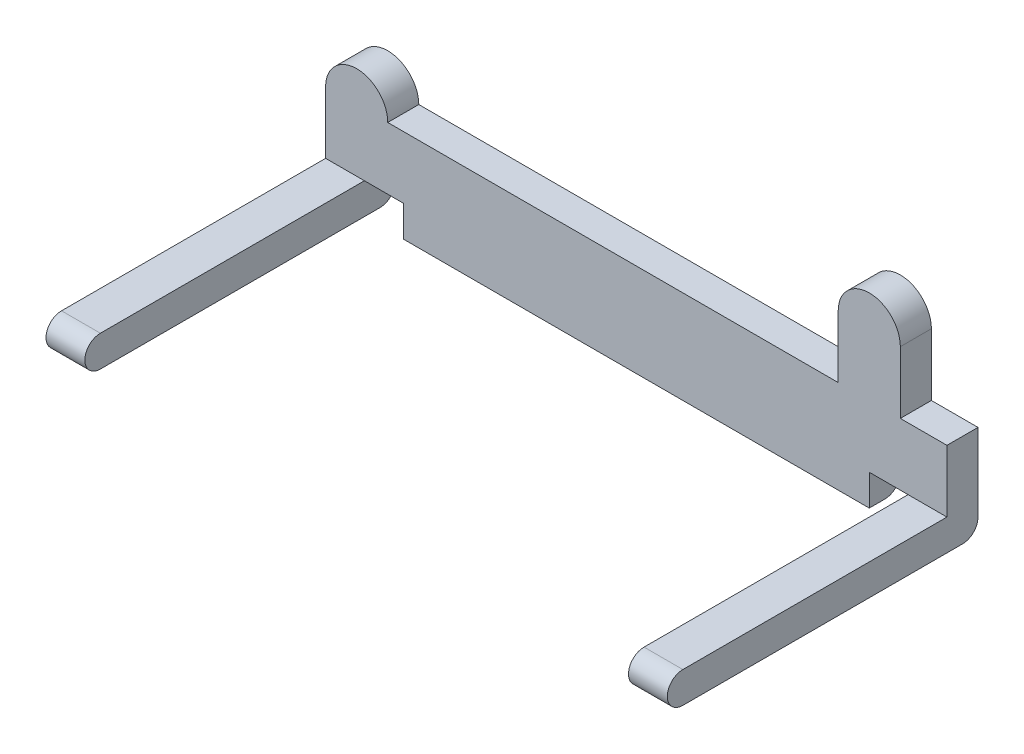
ISO-10303-21;
HEADER;
FILE_DESCRIPTION(('STEP AP214'),'2;1');
FILE_NAME('part.step','',(''),(''),'','','');
FILE_SCHEMA(('AUTOMOTIVE_DESIGN { 1 0 10303 214 1 1 1 1 }'));
ENDSEC;
DATA;
#1=APPLICATION_CONTEXT('core data for automotive mechanical design processes');
#2=APPLICATION_PROTOCOL_DEFINITION('international standard','automotive_design',2000,#1);
#3=PRODUCT_CONTEXT('',#1,'mechanical');
#4=PRODUCT('Part','Part','',(#3));
#5=PRODUCT_RELATED_PRODUCT_CATEGORY('part','',(#4));
#6=PRODUCT_DEFINITION_FORMATION('','',#4);
#7=PRODUCT_DEFINITION_CONTEXT('part definition',#1,'design');
#8=PRODUCT_DEFINITION('design','',#6,#7);
#9=PRODUCT_DEFINITION_SHAPE('','',#8);
#10=(LENGTH_UNIT() NAMED_UNIT(*) SI_UNIT(.MILLI.,.METRE.));
#11=(NAMED_UNIT(*) PLANE_ANGLE_UNIT() SI_UNIT($,.RADIAN.));
#12=(NAMED_UNIT(*) SI_UNIT($,.STERADIAN.) SOLID_ANGLE_UNIT());
#13=UNCERTAINTY_MEASURE_WITH_UNIT(LENGTH_MEASURE(1.E-05),#10,'distance_accuracy_value','');
#14=(GEOMETRIC_REPRESENTATION_CONTEXT(3) GLOBAL_UNCERTAINTY_ASSIGNED_CONTEXT((#13)) GLOBAL_UNIT_ASSIGNED_CONTEXT((#10,
#11,#12)) REPRESENTATION_CONTEXT('',''));
#15=CARTESIAN_POINT('',(0.,0.,0.));
#16=DIRECTION('',(0.,0.,1.));
#17=DIRECTION('',(1.,0.,0.));
#18=AXIS2_PLACEMENT_3D('',#15,#16,#17);
#19=CARTESIAN_POINT('',(80.,-2.,18.));
#20=DIRECTION('',(0.,1.,0.));
#21=DIRECTION('',(0.,0.,1.));
#22=AXIS2_PLACEMENT_3D('',#19,#20,#21);
#23=PLANE('',#22);
#24=DIRECTION('',(-1.,0.,0.));
#25=VECTOR('',#24,1.);
#26=CARTESIAN_POINT('',(80.,-1.99999999999999,-18.));
#27=LINE('',#26,#25);
#28=CARTESIAN_POINT('',(5.,-1.99999999999999,-18.));
#29=VERTEX_POINT('',#28);
#30=CARTESIAN_POINT('',(0.,-1.99999999999999,-18.));
#31=VERTEX_POINT('',#30);
#32=EDGE_CURVE('E312',#29,#31,#27,.T.);
#33=ORIENTED_EDGE('',*,*,#32,.F.);
#34=DIRECTION('',(0.,0.,1.));
#35=VECTOR('',#34,1.);
#36=CARTESIAN_POINT('',(4.99999999999999,-2.,18.));
#37=LINE('',#36,#35);
#38=CARTESIAN_POINT('',(4.99999999999999,-2.,18.));
#39=VERTEX_POINT('',#38);
#40=EDGE_CURVE('E218',#29,#39,#37,.T.);
#41=ORIENTED_EDGE('',*,*,#40,.T.);
#42=DIRECTION('',(-1.,0.,0.));
#43=VECTOR('',#42,1.);
#44=CARTESIAN_POINT('',(80.,-2.,18.));
#45=LINE('',#44,#43);
#46=CARTESIAN_POINT('',(0.,-2.,18.));
#47=VERTEX_POINT('',#46);
#48=EDGE_CURVE('E316',#39,#47,#45,.T.);
#49=ORIENTED_EDGE('',*,*,#48,.T.);
#50=DIRECTION('',(0.,0.,-1.));
#51=VECTOR('',#50,1.);
#52=CARTESIAN_POINT('',(0.,-2.,18.));
#53=LINE('',#52,#51);
#54=EDGE_CURVE('E295',#47,#31,#53,.T.);
#55=ORIENTED_EDGE('',*,*,#54,.T.);
#56=EDGE_LOOP('',(#33,#41,#49,#55));
#57=FACE_BOUND('',#56,.T.);
#58=ADVANCED_FACE('F38',(#57),#23,.F.);
#59=DIRECTION('',(0.,0.,-1.));
#60=VECTOR('',#59,1.);
#61=CARTESIAN_POINT('',(75.,-2.,18.));
#62=LINE('',#61,#60);
#63=CARTESIAN_POINT('',(75.,-2.,18.));
#64=VERTEX_POINT('',#63);
#65=CARTESIAN_POINT('',(75.,-2.,-18.));
#66=VERTEX_POINT('',#65);
#67=EDGE_CURVE('E225',#64,#66,#62,.T.);
#68=ORIENTED_EDGE('',*,*,#67,.T.);
#69=CARTESIAN_POINT('',(80.,-1.99999999999999,-18.));
#70=VERTEX_POINT('',#69);
#71=EDGE_CURVE('E314',#70,#66,#27,.T.);
#72=ORIENTED_EDGE('',*,*,#71,.F.);
#73=DIRECTION('',(0.,0.,-1.));
#74=VECTOR('',#73,1.);
#75=CARTESIAN_POINT('',(80.,-2.,18.));
#76=LINE('',#75,#74);
#77=CARTESIAN_POINT('',(80.,-2.,18.));
#78=VERTEX_POINT('',#77);
#79=EDGE_CURVE('E282',#78,#70,#76,.T.);
#80=ORIENTED_EDGE('',*,*,#79,.F.);
#81=EDGE_CURVE('E46',#78,#64,#45,.T.);
#82=ORIENTED_EDGE('',*,*,#81,.T.);
#83=EDGE_LOOP('',(#68,#72,#80,#82));
#84=FACE_BOUND('',#83,.T.);
#85=ADVANCED_FACE('F407',(#84),#23,.F.);
#86=CARTESIAN_POINT('',(80.,0.,-18.));
#87=DIRECTION('',(-1.,0.,0.));
#88=DIRECTION('',(0.,0.,1.));
#89=AXIS2_PLACEMENT_3D('',#86,#87,#88);
#90=CYLINDRICAL_SURFACE('',#89,2.);
#91=DIRECTION('',(-1.,0.,0.));
#92=VECTOR('',#91,1.);
#93=CARTESIAN_POINT('',(80.,0.,-20.));
#94=LINE('',#93,#92);
#95=CARTESIAN_POINT('',(4.99999999999999,0.,-20.));
#96=VERTEX_POINT('',#95);
#97=CARTESIAN_POINT('',(0.,0.,-20.));
#98=VERTEX_POINT('',#97);
#99=EDGE_CURVE('E308',#96,#98,#94,.T.);
#100=ORIENTED_EDGE('',*,*,#99,.F.);
#101=CARTESIAN_POINT('',(4.99999999999999,0.,-18.));
#102=DIRECTION('',(-1.,0.,0.));
#103=DIRECTION('',(0.,0.,1.));
#104=AXIS2_PLACEMENT_3D('',#101,#102,#103);
#105=CIRCLE('',#104,2.);
#106=EDGE_CURVE('E400',#96,#29,#105,.T.);
#107=ORIENTED_EDGE('',*,*,#106,.T.);
#108=ORIENTED_EDGE('',*,*,#32,.T.);
#109=CARTESIAN_POINT('',(0.,0.,-18.));
#110=DIRECTION('',(1.,0.,0.));
#111=DIRECTION('',(0.,0.,-1.));
#112=AXIS2_PLACEMENT_3D('',#109,#110,#111);
#113=CIRCLE('',#112,2.);
#114=EDGE_CURVE('E298',#31,#98,#113,.T.);
#115=ORIENTED_EDGE('',*,*,#114,.T.);
#116=EDGE_LOOP('',(#100,#107,#108,#115));
#117=FACE_BOUND('',#116,.T.);
#118=ADVANCED_FACE('F429',(#117),#90,.T.);
#119=ORIENTED_EDGE('',*,*,#71,.T.);
#120=CARTESIAN_POINT('',(75.,0.,-18.));
#121=DIRECTION('',(1.,0.,0.));
#122=DIRECTION('',(0.,0.,-1.));
#123=AXIS2_PLACEMENT_3D('',#120,#121,#122);
#124=CIRCLE('',#123,2.);
#125=CARTESIAN_POINT('',(75.,0.,-20.));
#126=VERTEX_POINT('',#125);
#127=EDGE_CURVE('E375',#66,#126,#124,.T.);
#128=ORIENTED_EDGE('',*,*,#127,.T.);
#129=CARTESIAN_POINT('',(80.,0.,-20.));
#130=VERTEX_POINT('',#129);
#131=EDGE_CURVE('E309',#130,#126,#94,.T.);
#132=ORIENTED_EDGE('',*,*,#131,.F.);
#133=CARTESIAN_POINT('',(80.,0.,-18.));
#134=DIRECTION('',(1.,0.,0.));
#135=DIRECTION('',(0.,0.,-1.));
#136=AXIS2_PLACEMENT_3D('',#133,#134,#135);
#137=CIRCLE('',#136,2.);
#138=EDGE_CURVE('E285',#70,#130,#137,.T.);
#139=ORIENTED_EDGE('',*,*,#138,.F.);
#140=EDGE_LOOP('',(#119,#128,#132,#139));
#141=FACE_BOUND('',#140,.T.);
#142=ADVANCED_FACE('F373',(#141),#90,.T.);
#143=CARTESIAN_POINT('',(80.,0.,18.));
#144=DIRECTION('',(-1.,0.,0.));
#145=DIRECTION('',(0.,0.,1.));
#146=AXIS2_PLACEMENT_3D('',#143,#144,#145);
#147=CYLINDRICAL_SURFACE('',#146,2.);
#148=ORIENTED_EDGE('',*,*,#48,.F.);
#149=CARTESIAN_POINT('',(4.99999999999999,0.,18.));
#150=DIRECTION('',(-1.,0.,0.));
#151=DIRECTION('',(0.,0.,1.));
#152=AXIS2_PLACEMENT_3D('',#149,#150,#151);
#153=CIRCLE('',#152,2.);
#154=CARTESIAN_POINT('',(5.,2.,18.));
#155=VERTEX_POINT('',#154);
#156=EDGE_CURVE('E222',#39,#155,#153,.T.);
#157=ORIENTED_EDGE('',*,*,#156,.T.);
#158=DIRECTION('',(-1.,0.,0.));
#159=VECTOR('',#158,1.);
#160=CARTESIAN_POINT('',(80.,2.,18.));
#161=LINE('',#160,#159);
#162=CARTESIAN_POINT('',(0.,2.,18.));
#163=VERTEX_POINT('',#162);
#164=EDGE_CURVE('E292',#155,#163,#161,.T.);
#165=ORIENTED_EDGE('',*,*,#164,.T.);
#166=CARTESIAN_POINT('',(0.,0.,18.));
#167=DIRECTION('',(1.,0.,0.));
#168=DIRECTION('',(0.,0.,-1.));
#169=AXIS2_PLACEMENT_3D('',#166,#167,#168);
#170=CIRCLE('',#169,2.);
#171=EDGE_CURVE('E271',#163,#47,#170,.T.);
#172=ORIENTED_EDGE('',*,*,#171,.T.);
#173=EDGE_LOOP('',(#148,#157,#165,#172));
#174=FACE_BOUND('',#173,.T.);
#175=ADVANCED_FACE('F331',(#174),#147,.T.);
#176=CARTESIAN_POINT('',(80.,2.,18.));
#177=DIRECTION('',(0.,-1.,0.));
#178=DIRECTION('',(0.,0.,-1.));
#179=AXIS2_PLACEMENT_3D('',#176,#177,#178);
#180=PLANE('',#179);
#181=ORIENTED_EDGE('',*,*,#164,.F.);
#182=DIRECTION('',(0.,0.,1.));
#183=VECTOR('',#182,1.);
#184=CARTESIAN_POINT('',(5.,2.00000000000001,-16.));
#185=LINE('',#184,#183);
#186=CARTESIAN_POINT('',(5.,2.00000000000001,-16.));
#187=VERTEX_POINT('',#186);
#188=EDGE_CURVE('E403',#187,#155,#185,.T.);
#189=ORIENTED_EDGE('',*,*,#188,.F.);
#190=DIRECTION('',(1.,0.,0.));
#191=VECTOR('',#190,1.);
#192=CARTESIAN_POINT('',(0.,2.00000000000001,-16.));
#193=LINE('',#192,#191);
#194=CARTESIAN_POINT('',(0.,2.00000000000001,-16.));
#195=VERTEX_POINT('',#194);
#196=EDGE_CURVE('E269',#195,#187,#193,.T.);
#197=ORIENTED_EDGE('',*,*,#196,.F.);
#198=DIRECTION('',(0.,0.,1.));
#199=VECTOR('',#198,1.);
#200=CARTESIAN_POINT('',(0.,2.,18.));
#201=LINE('',#200,#199);
#202=EDGE_CURVE('E283',#195,#163,#201,.T.);
#203=ORIENTED_EDGE('',*,*,#202,.T.);
#204=EDGE_LOOP('',(#181,#189,#197,#203));
#205=FACE_BOUND('',#204,.T.);
#206=ADVANCED_FACE('F336',(#205),#180,.F.);
#207=CARTESIAN_POINT('',(0.,10.,-20.));
#208=DIRECTION('',(0.,1.,0.));
#209=DIRECTION('',(0.,0.,1.));
#210=AXIS2_PLACEMENT_3D('',#207,#208,#209);
#211=PLANE('',#210);
#212=DIRECTION('',(0.,0.,-1.));
#213=VECTOR('',#212,1.);
#214=CARTESIAN_POINT('',(66.,9.99999999999999,-16.));
#215=LINE('',#214,#213);
#216=CARTESIAN_POINT('',(66.,9.99999999999999,-16.));
#217=VERTEX_POINT('',#216);
#218=CARTESIAN_POINT('',(66.,9.99999999999999,-20.));
#219=VERTEX_POINT('',#218);
#220=EDGE_CURVE('E248',#217,#219,#215,.T.);
#221=ORIENTED_EDGE('',*,*,#220,.T.);
#222=DIRECTION('',(1.,0.,0.));
#223=VECTOR('',#222,1.);
#224=CARTESIAN_POINT('',(0.,10.,-20.));
#225=LINE('',#224,#223);
#226=CARTESIAN_POINT('',(8.,10.,-20.));
#227=VERTEX_POINT('',#226);
#228=EDGE_CURVE('E277',#227,#219,#225,.T.);
#229=ORIENTED_EDGE('',*,*,#228,.F.);
#230=DIRECTION('',(0.,0.,-1.));
#231=VECTOR('',#230,1.);
#232=CARTESIAN_POINT('',(8.,10.,-16.));
#233=LINE('',#232,#231);
#234=CARTESIAN_POINT('',(8.,10.,-16.));
#235=VERTEX_POINT('',#234);
#236=EDGE_CURVE('E11',#235,#227,#233,.T.);
#237=ORIENTED_EDGE('',*,*,#236,.F.);
#238=DIRECTION('',(1.,0.,0.));
#239=VECTOR('',#238,1.);
#240=CARTESIAN_POINT('',(0.,10.,-16.));
#241=LINE('',#240,#239);
#242=EDGE_CURVE('E273',#235,#217,#241,.T.);
#243=ORIENTED_EDGE('',*,*,#242,.T.);
#244=EDGE_LOOP('',(#221,#229,#237,#243));
#245=FACE_BOUND('',#244,.T.);
#246=ADVANCED_FACE('F347',(#245),#211,.T.);
#247=CARTESIAN_POINT('',(80.,2.,18.));
#248=VERTEX_POINT('',#247);
#249=CARTESIAN_POINT('',(75.,2.,18.));
#250=VERTEX_POINT('',#249);
#251=EDGE_CURVE('E305',#248,#250,#161,.T.);
#252=ORIENTED_EDGE('',*,*,#251,.T.);
#253=CARTESIAN_POINT('',(75.,0.,18.));
#254=DIRECTION('',(1.,0.,0.));
#255=DIRECTION('',(0.,0.,-1.));
#256=AXIS2_PLACEMENT_3D('',#253,#254,#255);
#257=CIRCLE('',#256,2.);
#258=EDGE_CURVE('E219',#250,#64,#257,.T.);
#259=ORIENTED_EDGE('',*,*,#258,.T.);
#260=ORIENTED_EDGE('',*,*,#81,.F.);
#261=CARTESIAN_POINT('',(80.,0.,18.));
#262=DIRECTION('',(1.,0.,0.));
#263=DIRECTION('',(0.,0.,-1.));
#264=AXIS2_PLACEMENT_3D('',#261,#262,#263);
#265=CIRCLE('',#264,2.);
#266=EDGE_CURVE('E279',#248,#78,#265,.T.);
#267=ORIENTED_EDGE('',*,*,#266,.F.);
#268=EDGE_LOOP('',(#252,#259,#260,#267));
#269=FACE_BOUND('',#268,.T.);
#270=ADVANCED_FACE('F40',(#269),#147,.T.);
#271=DIRECTION('',(-1.,0.,0.));
#272=VECTOR('',#271,1.);
#273=CARTESIAN_POINT('',(80.,-1.99999999999999,-16.));
#274=LINE('',#273,#272);
#275=CARTESIAN_POINT('',(70.,-2.,-16.));
#276=VERTEX_POINT('',#275);
#277=CARTESIAN_POINT('',(9.99999999999999,-2.,-16.));
#278=VERTEX_POINT('',#277);
#279=EDGE_CURVE('E212',#276,#278,#274,.T.);
#280=ORIENTED_EDGE('',*,*,#279,.T.);
#281=DIRECTION('',(0.,0.,1.));
#282=VECTOR('',#281,1.);
#283=CARTESIAN_POINT('',(9.99999999999999,-2.,-26.));
#284=LINE('',#283,#282);
#285=CARTESIAN_POINT('',(9.99999999999999,-2.,-18.));
#286=VERTEX_POINT('',#285);
#287=EDGE_CURVE('E193',#286,#278,#284,.T.);
#288=ORIENTED_EDGE('',*,*,#287,.F.);
#289=CARTESIAN_POINT('',(70.,-2.,-18.));
#290=VERTEX_POINT('',#289);
#291=EDGE_CURVE('E317',#290,#286,#27,.T.);
#292=ORIENTED_EDGE('',*,*,#291,.F.);
#293=DIRECTION('',(0.,0.,1.));
#294=VECTOR('',#293,1.);
#295=CARTESIAN_POINT('',(70.,-2.,-26.));
#296=LINE('',#295,#294);
#297=EDGE_CURVE('E214',#290,#276,#296,.T.);
#298=ORIENTED_EDGE('',*,*,#297,.T.);
#299=EDGE_LOOP('',(#280,#288,#292,#298));
#300=FACE_BOUND('',#299,.T.);
#301=ADVANCED_FACE('F217',(#300),#23,.F.);
#302=ORIENTED_EDGE('',*,*,#291,.T.);
#303=CARTESIAN_POINT('',(9.99999999999999,0.,-18.));
#304=DIRECTION('',(1.,0.,0.));
#305=DIRECTION('',(0.,1.,0.));
#306=AXIS2_PLACEMENT_3D('',#303,#304,#305);
#307=CIRCLE('',#306,2.);
#308=CARTESIAN_POINT('',(9.99999999999999,0.,-20.));
#309=VERTEX_POINT('',#308);
#310=EDGE_CURVE('E200',#286,#309,#307,.T.);
#311=ORIENTED_EDGE('',*,*,#310,.T.);
#312=CARTESIAN_POINT('',(70.,0.,-20.));
#313=VERTEX_POINT('',#312);
#314=EDGE_CURVE('E313',#313,#309,#94,.T.);
#315=ORIENTED_EDGE('',*,*,#314,.F.);
#316=CARTESIAN_POINT('',(70.,0.,-18.));
#317=DIRECTION('',(-1.,0.,0.));
#318=DIRECTION('',(0.,0.,1.));
#319=AXIS2_PLACEMENT_3D('',#316,#317,#318);
#320=CIRCLE('',#319,2.);
#321=EDGE_CURVE('E383',#313,#290,#320,.T.);
#322=ORIENTED_EDGE('',*,*,#321,.T.);
#323=EDGE_LOOP('',(#302,#311,#315,#322));
#324=FACE_BOUND('',#323,.T.);
#325=ADVANCED_FACE('F432',(#324),#90,.T.);
#326=CARTESIAN_POINT('',(80.,2.00000000000001,-20.));
#327=DIRECTION('',(0.,0.,1.));
#328=DIRECTION('',(1.,0.,0.));
#329=AXIS2_PLACEMENT_3D('',#326,#327,#328);
#330=PLANE('',#329);
#331=DIRECTION('',(-1.,0.,0.));
#332=VECTOR('',#331,1.);
#333=CARTESIAN_POINT('',(80.,2.00000000000001,-20.));
#334=LINE('',#333,#332);
#335=CARTESIAN_POINT('',(10.,2.00000000000001,-20.));
#336=VERTEX_POINT('',#335);
#337=CARTESIAN_POINT('',(5.,2.00000000000001,-20.));
#338=VERTEX_POINT('',#337);
#339=EDGE_CURVE('E395',#336,#338,#334,.T.);
#340=ORIENTED_EDGE('',*,*,#339,.T.);
#341=DIRECTION('',(0.,-1.,0.));
#342=VECTOR('',#341,1.);
#343=CARTESIAN_POINT('',(4.99999999999999,2.00000000000001,-20.));
#344=LINE('',#343,#342);
#345=EDGE_CURVE('E397',#338,#96,#344,.T.);
#346=ORIENTED_EDGE('',*,*,#345,.T.);
#347=ORIENTED_EDGE('',*,*,#99,.T.);
#348=DIRECTION('',(0.,1.,0.));
#349=VECTOR('',#348,1.);
#350=CARTESIAN_POINT('',(0.,2.00000000000001,-20.));
#351=LINE('',#350,#349);
#352=CARTESIAN_POINT('',(0.,10.,-20.));
#353=VERTEX_POINT('',#352);
#354=EDGE_CURVE('E301',#98,#353,#351,.T.);
#355=ORIENTED_EDGE('',*,*,#354,.T.);
#356=CARTESIAN_POINT('',(4.,10.,-20.));
#357=DIRECTION('',(0.,0.,-1.));
#358=DIRECTION('',(-1.,0.,0.));
#359=AXIS2_PLACEMENT_3D('',#356,#357,#358);
#360=CIRCLE('',#359,4.);
#361=EDGE_CURVE('E60',#353,#227,#360,.T.);
#362=ORIENTED_EDGE('',*,*,#361,.T.);
#363=ORIENTED_EDGE('',*,*,#228,.T.);
#364=DIRECTION('',(0.,1.,0.));
#365=VECTOR('',#364,1.);
#366=CARTESIAN_POINT('',(66.,9.99999999999999,-20.));
#367=LINE('',#366,#365);
#368=CARTESIAN_POINT('',(66.,18.,-20.));
#369=VERTEX_POINT('',#368);
#370=EDGE_CURVE('E236',#219,#369,#367,.T.);
#371=ORIENTED_EDGE('',*,*,#370,.T.);
#372=CARTESIAN_POINT('',(70.,18.,-20.));
#373=DIRECTION('',(0.,0.,-1.));
#374=DIRECTION('',(-1.,0.,0.));
#375=AXIS2_PLACEMENT_3D('',#372,#373,#374);
#376=CIRCLE('',#375,4.);
#377=CARTESIAN_POINT('',(74.,18.,-20.));
#378=VERTEX_POINT('',#377);
#379=EDGE_CURVE('E231',#369,#378,#376,.T.);
#380=ORIENTED_EDGE('',*,*,#379,.T.);
#381=DIRECTION('',(0.,-1.,0.));
#382=VECTOR('',#381,1.);
#383=CARTESIAN_POINT('',(74.,10.,-20.));
#384=LINE('',#383,#382);
#385=CARTESIAN_POINT('',(74.,10.,-20.));
#386=VERTEX_POINT('',#385);
#387=EDGE_CURVE('E53',#378,#386,#384,.T.);
#388=ORIENTED_EDGE('',*,*,#387,.T.);
#389=CARTESIAN_POINT('',(80.,10.,-20.));
#390=VERTEX_POINT('',#389);
#391=EDGE_CURVE('E264',#386,#390,#225,.T.);
#392=ORIENTED_EDGE('',*,*,#391,.T.);
#393=DIRECTION('',(0.,1.,0.));
#394=VECTOR('',#393,1.);
#395=CARTESIAN_POINT('',(80.,2.00000000000001,-20.));
#396=LINE('',#395,#394);
#397=EDGE_CURVE('E287',#130,#390,#396,.T.);
#398=ORIENTED_EDGE('',*,*,#397,.F.);
#399=ORIENTED_EDGE('',*,*,#131,.T.);
#400=DIRECTION('',(0.,1.,0.));
#401=VECTOR('',#400,1.);
#402=CARTESIAN_POINT('',(75.,2.00000000000001,-20.));
#403=LINE('',#402,#401);
#404=CARTESIAN_POINT('',(75.,2.00000000000001,-20.));
#405=VERTEX_POINT('',#404);
#406=EDGE_CURVE('E378',#126,#405,#403,.T.);
#407=ORIENTED_EDGE('',*,*,#406,.T.);
#408=DIRECTION('',(-1.,0.,0.));
#409=VECTOR('',#408,1.);
#410=CARTESIAN_POINT('',(80.,2.00000000000001,-20.));
#411=LINE('',#410,#409);
#412=CARTESIAN_POINT('',(70.,2.00000000000001,-20.));
#413=VERTEX_POINT('',#412);
#414=EDGE_CURVE('E380',#405,#413,#411,.T.);
#415=ORIENTED_EDGE('',*,*,#414,.T.);
#416=DIRECTION('',(0.,-1.,0.));
#417=VECTOR('',#416,1.);
#418=CARTESIAN_POINT('',(70.,2.00000000000001,-20.));
#419=LINE('',#418,#417);
#420=EDGE_CURVE('E388',#413,#313,#419,.T.);
#421=ORIENTED_EDGE('',*,*,#420,.T.);
#422=ORIENTED_EDGE('',*,*,#314,.T.);
#423=DIRECTION('',(0.,1.,0.));
#424=VECTOR('',#423,1.);
#425=CARTESIAN_POINT('',(9.99999999999999,2.00000000000007,-20.));
#426=LINE('',#425,#424);
#427=EDGE_CURVE('E385',#309,#336,#426,.T.);
#428=ORIENTED_EDGE('',*,*,#427,.T.);
#429=EDGE_LOOP('',(#340,#346,#347,#355,#362,#363,#371,#380,#388,#392,#398,#399,#407,#415,#421,
#422,#428));
#430=FACE_BOUND('',#429,.T.);
#431=ADVANCED_FACE('F349',(#430),#330,.F.);
#432=CARTESIAN_POINT('',(75.,2.00000000000001,-16.));
#433=VERTEX_POINT('',#432);
#434=CARTESIAN_POINT('',(80.,2.00000000000001,-16.));
#435=VERTEX_POINT('',#434);
#436=EDGE_CURVE('E272',#433,#435,#193,.T.);
#437=ORIENTED_EDGE('',*,*,#436,.F.);
#438=DIRECTION('',(0.,0.,-1.));
#439=VECTOR('',#438,1.);
#440=CARTESIAN_POINT('',(75.,2.00000000000001,-16.));
#441=LINE('',#440,#439);
#442=EDGE_CURVE('E405',#250,#433,#441,.T.);
#443=ORIENTED_EDGE('',*,*,#442,.F.);
#444=ORIENTED_EDGE('',*,*,#251,.F.);
#445=DIRECTION('',(0.,0.,1.));
#446=VECTOR('',#445,1.);
#447=CARTESIAN_POINT('',(80.,2.00000000000001,-18.));
#448=LINE('',#447,#446);
#449=EDGE_CURVE('E290',#435,#248,#448,.T.);
#450=ORIENTED_EDGE('',*,*,#449,.F.);
#451=EDGE_LOOP('',(#437,#443,#444,#450));
#452=FACE_BOUND('',#451,.T.);
#453=ADVANCED_FACE('F449',(#452),#180,.F.);
#454=CARTESIAN_POINT('',(80.,0.,18.));
#455=DIRECTION('',(1.,0.,0.));
#456=DIRECTION('',(0.,0.,-1.));
#457=AXIS2_PLACEMENT_3D('',#454,#455,#456);
#458=PLANE('',#457);
#459=ORIENTED_EDGE('',*,*,#266,.T.);
#460=ORIENTED_EDGE('',*,*,#79,.T.);
#461=ORIENTED_EDGE('',*,*,#138,.T.);
#462=ORIENTED_EDGE('',*,*,#397,.T.);
#463=DIRECTION('',(0.,0.,1.));
#464=VECTOR('',#463,1.);
#465=CARTESIAN_POINT('',(80.,10.,-20.));
#466=LINE('',#465,#464);
#467=CARTESIAN_POINT('',(80.,10.,-16.));
#468=VERTEX_POINT('',#467);
#469=EDGE_CURVE('E256',#390,#468,#466,.T.);
#470=ORIENTED_EDGE('',*,*,#469,.T.);
#471=DIRECTION('',(0.,-1.,0.));
#472=VECTOR('',#471,1.);
#473=CARTESIAN_POINT('',(80.,2.00000000000001,-16.));
#474=LINE('',#473,#472);
#475=EDGE_CURVE('E261',#468,#435,#474,.T.);
#476=ORIENTED_EDGE('',*,*,#475,.T.);
#477=ORIENTED_EDGE('',*,*,#449,.T.);
#478=EDGE_LOOP('',(#459,#460,#461,#462,#470,#476,#477));
#479=FACE_BOUND('',#478,.T.);
#480=ADVANCED_FACE('F367',(#479),#458,.T.);
#481=CARTESIAN_POINT('',(0.,0.,18.));
#482=DIRECTION('',(1.,0.,0.));
#483=DIRECTION('',(0.,0.,-1.));
#484=AXIS2_PLACEMENT_3D('',#481,#482,#483);
#485=PLANE('',#484);
#486=ORIENTED_EDGE('',*,*,#171,.F.);
#487=ORIENTED_EDGE('',*,*,#202,.F.);
#488=DIRECTION('',(0.,-1.,0.));
#489=VECTOR('',#488,1.);
#490=CARTESIAN_POINT('',(0.,2.00000000000001,-16.));
#491=LINE('',#490,#489);
#492=CARTESIAN_POINT('',(0.,10.,-16.));
#493=VERTEX_POINT('',#492);
#494=EDGE_CURVE('E260',#493,#195,#491,.T.);
#495=ORIENTED_EDGE('',*,*,#494,.F.);
#496=DIRECTION('',(0.,0.,1.));
#497=VECTOR('',#496,1.);
#498=CARTESIAN_POINT('',(0.,10.,-20.));
#499=LINE('',#498,#497);
#500=EDGE_CURVE('E258',#353,#493,#499,.T.);
#501=ORIENTED_EDGE('',*,*,#500,.F.);
#502=ORIENTED_EDGE('',*,*,#354,.F.);
#503=ORIENTED_EDGE('',*,*,#114,.F.);
#504=ORIENTED_EDGE('',*,*,#54,.F.);
#505=EDGE_LOOP('',(#486,#487,#495,#501,#502,#503,#504));
#506=FACE_BOUND('',#505,.T.);
#507=ADVANCED_FACE('F329',(#506),#485,.F.);
#508=CARTESIAN_POINT('',(0.,2.00000000000001,-16.));
#509=DIRECTION('',(0.,0.,1.));
#510=DIRECTION('',(1.,0.,0.));
#511=AXIS2_PLACEMENT_3D('',#508,#509,#510);
#512=PLANE('',#511);
#513=DIRECTION('',(-1.,0.,0.));
#514=VECTOR('',#513,1.);
#515=CARTESIAN_POINT('',(5.,2.00000000000001,-16.));
#516=LINE('',#515,#514);
#517=CARTESIAN_POINT('',(10.,2.00000000000001,-16.));
#518=VERTEX_POINT('',#517);
#519=EDGE_CURVE('E206',#518,#187,#516,.T.);
#520=ORIENTED_EDGE('',*,*,#519,.F.);
#521=DIRECTION('',(0.,1.,0.));
#522=VECTOR('',#521,1.);
#523=CARTESIAN_POINT('',(10.,2.00000000000001,-16.));
#524=LINE('',#523,#522);
#525=EDGE_CURVE('E197',#278,#518,#524,.T.);
#526=ORIENTED_EDGE('',*,*,#525,.F.);
#527=ORIENTED_EDGE('',*,*,#279,.F.);
#528=DIRECTION('',(0.,-1.,0.));
#529=VECTOR('',#528,1.);
#530=CARTESIAN_POINT('',(70.,2.00000000000001,-16.));
#531=LINE('',#530,#529);
#532=CARTESIAN_POINT('',(70.,2.00000000000001,-16.));
#533=VERTEX_POINT('',#532);
#534=EDGE_CURVE('E542',#533,#276,#531,.T.);
#535=ORIENTED_EDGE('',*,*,#534,.F.);
#536=DIRECTION('',(-1.,0.,0.));
#537=VECTOR('',#536,1.);
#538=CARTESIAN_POINT('',(75.,2.00000000000001,-16.));
#539=LINE('',#538,#537);
#540=EDGE_CURVE('E539',#433,#533,#539,.T.);
#541=ORIENTED_EDGE('',*,*,#540,.F.);
#542=ORIENTED_EDGE('',*,*,#436,.T.);
#543=ORIENTED_EDGE('',*,*,#475,.F.);
#544=CARTESIAN_POINT('',(74.,10.,-16.));
#545=VERTEX_POINT('',#544);
#546=EDGE_CURVE('E276',#545,#468,#241,.T.);
#547=ORIENTED_EDGE('',*,*,#546,.F.);
#548=DIRECTION('',(0.,-1.,0.));
#549=VECTOR('',#548,1.);
#550=CARTESIAN_POINT('',(74.,10.,-16.));
#551=LINE('',#550,#549);
#552=CARTESIAN_POINT('',(74.,18.,-16.));
#553=VERTEX_POINT('',#552);
#554=EDGE_CURVE('E235',#553,#545,#551,.T.);
#555=ORIENTED_EDGE('',*,*,#554,.F.);
#556=CARTESIAN_POINT('',(70.,18.,-16.));
#557=DIRECTION('',(0.,0.,-1.));
#558=DIRECTION('',(-1.,0.,0.));
#559=AXIS2_PLACEMENT_3D('',#556,#557,#558);
#560=CIRCLE('',#559,4.);
#561=CARTESIAN_POINT('',(66.,18.,-16.));
#562=VERTEX_POINT('',#561);
#563=EDGE_CURVE('E232',#562,#553,#560,.T.);
#564=ORIENTED_EDGE('',*,*,#563,.F.);
#565=DIRECTION('',(0.,1.,0.));
#566=VECTOR('',#565,1.);
#567=CARTESIAN_POINT('',(66.,9.99999999999999,-16.));
#568=LINE('',#567,#566);
#569=EDGE_CURVE('E238',#217,#562,#568,.T.);
#570=ORIENTED_EDGE('',*,*,#569,.F.);
#571=ORIENTED_EDGE('',*,*,#242,.F.);
#572=CARTESIAN_POINT('',(4.,10.,-16.));
#573=DIRECTION('',(0.,0.,-1.));
#574=DIRECTION('',(-1.,0.,0.));
#575=AXIS2_PLACEMENT_3D('',#572,#573,#574);
#576=CIRCLE('',#575,4.);
#577=EDGE_CURVE('E254',#493,#235,#576,.T.);
#578=ORIENTED_EDGE('',*,*,#577,.F.);
#579=ORIENTED_EDGE('',*,*,#494,.T.);
#580=ORIENTED_EDGE('',*,*,#196,.T.);
#581=EDGE_LOOP('',(#520,#526,#527,#535,#541,#542,#543,#547,#555,#564,#570,#571,#578,#579,#580));
#582=FACE_BOUND('',#581,.T.);
#583=ADVANCED_FACE('F210',(#582),#512,.T.);
#584=DIRECTION('',(0.,0.,-1.));
#585=VECTOR('',#584,1.);
#586=CARTESIAN_POINT('',(74.,10.,-16.));
#587=LINE('',#586,#585);
#588=EDGE_CURVE('E251',#545,#386,#587,.T.);
#589=ORIENTED_EDGE('',*,*,#588,.F.);
#590=ORIENTED_EDGE('',*,*,#546,.T.);
#591=ORIENTED_EDGE('',*,*,#469,.F.);
#592=ORIENTED_EDGE('',*,*,#391,.F.);
#593=EDGE_LOOP('',(#589,#590,#591,#592));
#594=FACE_BOUND('',#593,.T.);
#595=ADVANCED_FACE('F364',(#594),#211,.T.);
#596=CARTESIAN_POINT('',(4.,10.,-16.));
#597=DIRECTION('',(0.,0.,-1.));
#598=DIRECTION('',(-1.,0.,0.));
#599=AXIS2_PLACEMENT_3D('',#596,#597,#598);
#600=CYLINDRICAL_SURFACE('',#599,4.);
#601=ORIENTED_EDGE('',*,*,#577,.T.);
#602=ORIENTED_EDGE('',*,*,#236,.T.);
#603=ORIENTED_EDGE('',*,*,#361,.F.);
#604=ORIENTED_EDGE('',*,*,#500,.T.);
#605=EDGE_LOOP('',(#601,#602,#603,#604));
#606=FACE_BOUND('',#605,.T.);
#607=ADVANCED_FACE('F344',(#606),#600,.T.);
#608=CARTESIAN_POINT('',(70.,18.,-16.));
#609=DIRECTION('',(0.,0.,-1.));
#610=DIRECTION('',(-1.,0.,0.));
#611=AXIS2_PLACEMENT_3D('',#608,#609,#610);
#612=CYLINDRICAL_SURFACE('',#611,4.);
#613=ORIENTED_EDGE('',*,*,#379,.F.);
#614=DIRECTION('',(0.,0.,-1.));
#615=VECTOR('',#614,1.);
#616=CARTESIAN_POINT('',(66.,18.,-16.));
#617=LINE('',#616,#615);
#618=EDGE_CURVE('E246',#562,#369,#617,.T.);
#619=ORIENTED_EDGE('',*,*,#618,.F.);
#620=ORIENTED_EDGE('',*,*,#563,.T.);
#621=DIRECTION('',(0.,0.,-1.));
#622=VECTOR('',#621,1.);
#623=CARTESIAN_POINT('',(74.,18.,-16.));
#624=LINE('',#623,#622);
#625=EDGE_CURVE('E241',#553,#378,#624,.T.);
#626=ORIENTED_EDGE('',*,*,#625,.T.);
#627=EDGE_LOOP('',(#613,#619,#620,#626));
#628=FACE_BOUND('',#627,.T.);
#629=ADVANCED_FACE('F355',(#628),#612,.T.);
#630=CARTESIAN_POINT('',(66.,9.99999999999999,-16.));
#631=DIRECTION('',(-1.,0.,0.));
#632=DIRECTION('',(0.,0.,1.));
#633=AXIS2_PLACEMENT_3D('',#630,#631,#632);
#634=PLANE('',#633);
#635=ORIENTED_EDGE('',*,*,#370,.F.);
#636=ORIENTED_EDGE('',*,*,#220,.F.);
#637=ORIENTED_EDGE('',*,*,#569,.T.);
#638=ORIENTED_EDGE('',*,*,#618,.T.);
#639=EDGE_LOOP('',(#635,#636,#637,#638));
#640=FACE_BOUND('',#639,.T.);
#641=ADVANCED_FACE('F352',(#640),#634,.T.);
#642=CARTESIAN_POINT('',(74.,10.,-16.));
#643=DIRECTION('',(1.,0.,0.));
#644=DIRECTION('',(0.,0.,-1.));
#645=AXIS2_PLACEMENT_3D('',#642,#643,#644);
#646=PLANE('',#645);
#647=ORIENTED_EDGE('',*,*,#387,.F.);
#648=ORIENTED_EDGE('',*,*,#625,.F.);
#649=ORIENTED_EDGE('',*,*,#554,.T.);
#650=ORIENTED_EDGE('',*,*,#588,.T.);
#651=EDGE_LOOP('',(#647,#648,#649,#650));
#652=FACE_BOUND('',#651,.T.);
#653=ADVANCED_FACE('F358',(#652),#646,.T.);
#654=CARTESIAN_POINT('',(5.,-7.99999999999999,-16.));
#655=DIRECTION('',(-1.,0.,0.));
#656=DIRECTION('',(0.,0.,1.));
#657=AXIS2_PLACEMENT_3D('',#654,#655,#656);
#658=PLANE('',#657);
#659=ORIENTED_EDGE('',*,*,#40,.F.);
#660=ORIENTED_EDGE('',*,*,#106,.F.);
#661=ORIENTED_EDGE('',*,*,#345,.F.);
#662=DIRECTION('',(0.,0.,1.));
#663=VECTOR('',#662,1.);
#664=CARTESIAN_POINT('',(5.,2.00000000000001,-26.));
#665=LINE('',#664,#663);
#666=EDGE_CURVE('E534',#338,#187,#665,.T.);
#667=ORIENTED_EDGE('',*,*,#666,.T.);
#668=ORIENTED_EDGE('',*,*,#188,.T.);
#669=ORIENTED_EDGE('',*,*,#156,.F.);
#670=EDGE_LOOP('',(#659,#660,#661,#667,#668,#669));
#671=FACE_BOUND('',#670,.T.);
#672=ADVANCED_FACE('F413',(#671),#658,.F.);
#673=CARTESIAN_POINT('',(75.,-7.99999999999999,-16.));
#674=DIRECTION('',(1.,0.,0.));
#675=DIRECTION('',(0.,0.,-1.));
#676=AXIS2_PLACEMENT_3D('',#673,#674,#675);
#677=PLANE('',#676);
#678=ORIENTED_EDGE('',*,*,#442,.T.);
#679=DIRECTION('',(0.,0.,1.));
#680=VECTOR('',#679,1.);
#681=CARTESIAN_POINT('',(75.,2.00000000000001,-26.));
#682=LINE('',#681,#680);
#683=EDGE_CURVE('E544',#405,#433,#682,.T.);
#684=ORIENTED_EDGE('',*,*,#683,.F.);
#685=ORIENTED_EDGE('',*,*,#406,.F.);
#686=ORIENTED_EDGE('',*,*,#127,.F.);
#687=ORIENTED_EDGE('',*,*,#67,.F.);
#688=ORIENTED_EDGE('',*,*,#258,.F.);
#689=EDGE_LOOP('',(#678,#684,#685,#686,#687,#688));
#690=FACE_BOUND('',#689,.T.);
#691=ADVANCED_FACE('F408',(#690),#677,.F.);
#692=CARTESIAN_POINT('',(70.,2.00000000000001,-26.));
#693=DIRECTION('',(-1.,0.,0.));
#694=DIRECTION('',(0.,0.,1.));
#695=AXIS2_PLACEMENT_3D('',#692,#693,#694);
#696=PLANE('',#695);
#697=ORIENTED_EDGE('',*,*,#420,.F.);
#698=DIRECTION('',(0.,0.,1.));
#699=VECTOR('',#698,1.);
#700=CARTESIAN_POINT('',(70.,2.00000000000001,-26.));
#701=LINE('',#700,#699);
#702=EDGE_CURVE('E546',#413,#533,#701,.T.);
#703=ORIENTED_EDGE('',*,*,#702,.T.);
#704=ORIENTED_EDGE('',*,*,#534,.T.);
#705=ORIENTED_EDGE('',*,*,#297,.F.);
#706=ORIENTED_EDGE('',*,*,#321,.F.);
#707=EDGE_LOOP('',(#697,#703,#704,#705,#706));
#708=FACE_BOUND('',#707,.T.);
#709=ADVANCED_FACE('F412',(#708),#696,.F.);
#710=CARTESIAN_POINT('',(75.,2.00000000000001,-26.));
#711=DIRECTION('',(0.,1.,0.));
#712=DIRECTION('',(-1.,0.,0.));
#713=AXIS2_PLACEMENT_3D('',#710,#711,#712);
#714=PLANE('',#713);
#715=ORIENTED_EDGE('',*,*,#683,.T.);
#716=ORIENTED_EDGE('',*,*,#540,.T.);
#717=ORIENTED_EDGE('',*,*,#702,.F.);
#718=ORIENTED_EDGE('',*,*,#414,.F.);
#719=EDGE_LOOP('',(#715,#716,#717,#718));
#720=FACE_BOUND('',#719,.T.);
#721=ADVANCED_FACE('F419',(#720),#714,.F.);
#722=CARTESIAN_POINT('',(5.,2.00000000000001,-26.));
#723=DIRECTION('',(0.,1.,0.));
#724=DIRECTION('',(0.,0.,1.));
#725=AXIS2_PLACEMENT_3D('',#722,#723,#724);
#726=PLANE('',#725);
#727=DIRECTION('',(0.,0.,1.));
#728=VECTOR('',#727,1.);
#729=CARTESIAN_POINT('',(10.,2.00000000000001,-26.));
#730=LINE('',#729,#728);
#731=EDGE_CURVE('E205',#336,#518,#730,.T.);
#732=ORIENTED_EDGE('',*,*,#731,.T.);
#733=ORIENTED_EDGE('',*,*,#519,.T.);
#734=ORIENTED_EDGE('',*,*,#666,.F.);
#735=ORIENTED_EDGE('',*,*,#339,.F.);
#736=EDGE_LOOP('',(#732,#733,#734,#735));
#737=FACE_BOUND('',#736,.T.);
#738=ADVANCED_FACE('F511',(#737),#726,.F.);
#739=CARTESIAN_POINT('',(10.,2.00000000000001,-26.));
#740=DIRECTION('',(1.,0.,0.));
#741=DIRECTION('',(0.,1.,0.));
#742=AXIS2_PLACEMENT_3D('',#739,#740,#741);
#743=PLANE('',#742);
#744=ORIENTED_EDGE('',*,*,#287,.T.);
#745=ORIENTED_EDGE('',*,*,#525,.T.);
#746=ORIENTED_EDGE('',*,*,#731,.F.);
#747=ORIENTED_EDGE('',*,*,#427,.F.);
#748=ORIENTED_EDGE('',*,*,#310,.F.);
#749=EDGE_LOOP('',(#744,#745,#746,#747,#748));
#750=FACE_BOUND('',#749,.T.);
#751=ADVANCED_FACE('F195',(#750),#743,.F.);
#752=CLOSED_SHELL('',(#58,#85,#118,#142,#175,#206,#246,#270,#301,#325,#431,#453,#480,#507,#583,
#595,#607,#629,#641,#653,#672,#691,#709,#721,#738,#751));
#753=MANIFOLD_SOLID_BREP('B2',#752);
#754=ADVANCED_BREP_SHAPE_REPRESENTATION('',(#18,#753),#14);
#755=SHAPE_DEFINITION_REPRESENTATION(#9,#754);
ENDSEC;
END-ISO-10303-21;
